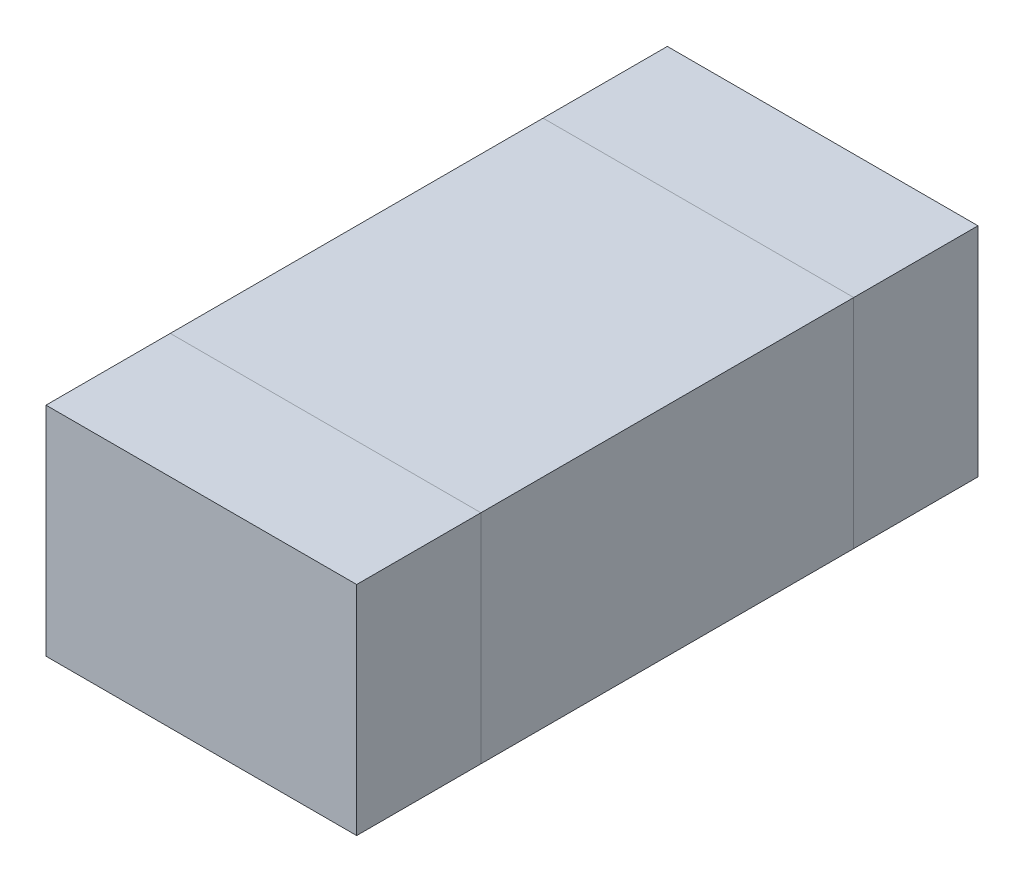
ISO-10303-21;
HEADER;
FILE_DESCRIPTION(('STEP AP214'),'2;1');
FILE_NAME('part.step','',(''),(''),'','','');
FILE_SCHEMA(('AUTOMOTIVE_DESIGN { 1 0 10303 214 1 1 1 1 }'));
ENDSEC;
DATA;
#1=APPLICATION_CONTEXT('core data for automotive mechanical design processes');
#2=APPLICATION_PROTOCOL_DEFINITION('international standard','automotive_design',2000,#1);
#3=PRODUCT_CONTEXT('',#1,'mechanical');
#4=PRODUCT('Part','Part','',(#3));
#5=PRODUCT_RELATED_PRODUCT_CATEGORY('part','',(#4));
#6=PRODUCT_DEFINITION_FORMATION('','',#4);
#7=PRODUCT_DEFINITION_CONTEXT('part definition',#1,'design');
#8=PRODUCT_DEFINITION('design','',#6,#7);
#9=PRODUCT_DEFINITION_SHAPE('','',#8);
#10=(LENGTH_UNIT() NAMED_UNIT(*) SI_UNIT(.MILLI.,.METRE.));
#11=(NAMED_UNIT(*) PLANE_ANGLE_UNIT() SI_UNIT($,.RADIAN.));
#12=(NAMED_UNIT(*) SI_UNIT($,.STERADIAN.) SOLID_ANGLE_UNIT());
#13=UNCERTAINTY_MEASURE_WITH_UNIT(LENGTH_MEASURE(1.E-05),#10,'distance_accuracy_value','');
#14=(GEOMETRIC_REPRESENTATION_CONTEXT(3) GLOBAL_UNCERTAINTY_ASSIGNED_CONTEXT((#13)) GLOBAL_UNIT_ASSIGNED_CONTEXT((#10,
#11,#12)) REPRESENTATION_CONTEXT('',''));
#15=CARTESIAN_POINT('',(0.,0.,0.));
#16=DIRECTION('',(0.,0.,1.));
#17=DIRECTION('',(1.,0.,0.));
#18=AXIS2_PLACEMENT_3D('',#15,#16,#17);
#19=CARTESIAN_POINT('',(0.,0.35,0.));
#20=DIRECTION('',(0.,1.,0.));
#21=DIRECTION('',(0.,0.,1.));
#22=AXIS2_PLACEMENT_3D('',#19,#20,#21);
#23=PLANE('',#22);
#24=DIRECTION('',(0.,0.,-1.));
#25=VECTOR('',#24,1.);
#26=CARTESIAN_POINT('',(-0.25,0.35,-0.3));
#27=LINE('',#26,#25);
#28=CARTESIAN_POINT('',(-0.25,0.35,-0.3));
#29=VERTEX_POINT('',#28);
#30=CARTESIAN_POINT('',(-0.25,0.35,-0.5));
#31=VERTEX_POINT('',#30);
#32=EDGE_CURVE('E56',#29,#31,#27,.T.);
#33=ORIENTED_EDGE('',*,*,#32,.F.);
#34=DIRECTION('',(-1.,0.,0.));
#35=VECTOR('',#34,1.);
#36=CARTESIAN_POINT('',(-0.25,0.35,-0.3));
#37=LINE('',#36,#35);
#38=CARTESIAN_POINT('',(0.25,0.35,-0.3));
#39=VERTEX_POINT('',#38);
#40=EDGE_CURVE('E79',#39,#29,#37,.T.);
#41=ORIENTED_EDGE('',*,*,#40,.F.);
#42=DIRECTION('',(0.,0.,1.));
#43=VECTOR('',#42,1.);
#44=CARTESIAN_POINT('',(0.25,0.35,-0.3));
#45=LINE('',#44,#43);
#46=CARTESIAN_POINT('',(0.25,0.35,-0.5));
#47=VERTEX_POINT('',#46);
#48=EDGE_CURVE('E84',#47,#39,#45,.T.);
#49=ORIENTED_EDGE('',*,*,#48,.F.);
#50=DIRECTION('',(1.,0.,0.));
#51=VECTOR('',#50,1.);
#52=CARTESIAN_POINT('',(-0.25,0.35,-0.5));
#53=LINE('',#52,#51);
#54=EDGE_CURVE('E99',#31,#47,#53,.T.);
#55=ORIENTED_EDGE('',*,*,#54,.F.);
#56=EDGE_LOOP('',(#33,#41,#49,#55));
#57=FACE_BOUND('',#56,.T.);
#58=ADVANCED_FACE('F48',(#57),#23,.T.);
#59=CARTESIAN_POINT('',(0.,0.,0.));
#60=DIRECTION('',(0.,-1.,0.));
#61=DIRECTION('',(0.,0.,-1.));
#62=AXIS2_PLACEMENT_3D('',#59,#60,#61);
#63=PLANE('',#62);
#64=DIRECTION('',(0.,0.,-1.));
#65=VECTOR('',#64,1.);
#66=CARTESIAN_POINT('',(-0.25,0.,-0.3));
#67=LINE('',#66,#65);
#68=CARTESIAN_POINT('',(-0.25,0.,-0.3));
#69=VERTEX_POINT('',#68);
#70=CARTESIAN_POINT('',(-0.25,0.,-0.5));
#71=VERTEX_POINT('',#70);
#72=EDGE_CURVE('E108',#69,#71,#67,.T.);
#73=ORIENTED_EDGE('',*,*,#72,.T.);
#74=DIRECTION('',(1.,0.,0.));
#75=VECTOR('',#74,1.);
#76=CARTESIAN_POINT('',(-0.25,0.,-0.5));
#77=LINE('',#76,#75);
#78=CARTESIAN_POINT('',(0.25,0.,-0.5));
#79=VERTEX_POINT('',#78);
#80=EDGE_CURVE('E97',#71,#79,#77,.T.);
#81=ORIENTED_EDGE('',*,*,#80,.T.);
#82=DIRECTION('',(0.,0.,1.));
#83=VECTOR('',#82,1.);
#84=CARTESIAN_POINT('',(0.25,0.,-0.3));
#85=LINE('',#84,#83);
#86=CARTESIAN_POINT('',(0.25,0.,-0.3));
#87=VERTEX_POINT('',#86);
#88=EDGE_CURVE('E100',#79,#87,#85,.T.);
#89=ORIENTED_EDGE('',*,*,#88,.T.);
#90=DIRECTION('',(-1.,0.,0.));
#91=VECTOR('',#90,1.);
#92=CARTESIAN_POINT('',(-0.25,0.,-0.3));
#93=LINE('',#92,#91);
#94=EDGE_CURVE('E105',#87,#69,#93,.T.);
#95=ORIENTED_EDGE('',*,*,#94,.T.);
#96=EDGE_LOOP('',(#73,#81,#89,#95));
#97=FACE_BOUND('',#96,.T.);
#98=ADVANCED_FACE('F107',(#97),#63,.T.);
#99=CARTESIAN_POINT('',(-0.25,0.888516480713451,-0.5));
#100=DIRECTION('',(0.,0.,-1.));
#101=DIRECTION('',(-1.,0.,0.));
#102=AXIS2_PLACEMENT_3D('',#99,#100,#101);
#103=PLANE('',#102);
#104=DIRECTION('',(0.,-1.,0.));
#105=VECTOR('',#104,1.);
#106=CARTESIAN_POINT('',(-0.25,0.888516480713451,-0.5));
#107=LINE('',#106,#105);
#108=EDGE_CURVE('E12',#31,#71,#107,.T.);
#109=ORIENTED_EDGE('',*,*,#108,.F.);
#110=ORIENTED_EDGE('',*,*,#54,.T.);
#111=DIRECTION('',(0.,-1.,0.));
#112=VECTOR('',#111,1.);
#113=CARTESIAN_POINT('',(0.25,0.888516480713451,-0.5));
#114=LINE('',#113,#112);
#115=EDGE_CURVE('E94',#47,#79,#114,.T.);
#116=ORIENTED_EDGE('',*,*,#115,.T.);
#117=ORIENTED_EDGE('',*,*,#80,.F.);
#118=EDGE_LOOP('',(#109,#110,#116,#117));
#119=FACE_BOUND('',#118,.T.);
#120=ADVANCED_FACE('F95',(#119),#103,.T.);
#121=CARTESIAN_POINT('',(0.25,0.888516480713451,-0.3));
#122=DIRECTION('',(1.,0.,0.));
#123=DIRECTION('',(0.,0.,-1.));
#124=AXIS2_PLACEMENT_3D('',#121,#122,#123);
#125=PLANE('',#124);
#126=ORIENTED_EDGE('',*,*,#115,.F.);
#127=ORIENTED_EDGE('',*,*,#48,.T.);
#128=DIRECTION('',(0.,-1.,0.));
#129=VECTOR('',#128,1.);
#130=CARTESIAN_POINT('',(0.25,0.888516480713451,-0.3));
#131=LINE('',#130,#129);
#132=EDGE_CURVE('E89',#39,#87,#131,.T.);
#133=ORIENTED_EDGE('',*,*,#132,.T.);
#134=ORIENTED_EDGE('',*,*,#88,.F.);
#135=EDGE_LOOP('',(#126,#127,#133,#134));
#136=FACE_BOUND('',#135,.T.);
#137=ADVANCED_FACE('F101',(#136),#125,.T.);
#138=CARTESIAN_POINT('',(-0.25,0.888516480713451,-0.3));
#139=DIRECTION('',(0.,0.,1.));
#140=DIRECTION('',(1.,0.,0.));
#141=AXIS2_PLACEMENT_3D('',#138,#139,#140);
#142=PLANE('',#141);
#143=ORIENTED_EDGE('',*,*,#132,.F.);
#144=ORIENTED_EDGE('',*,*,#40,.T.);
#145=DIRECTION('',(0.,-1.,0.));
#146=VECTOR('',#145,1.);
#147=CARTESIAN_POINT('',(-0.25,0.888516480713451,-0.3));
#148=LINE('',#147,#146);
#149=EDGE_CURVE('E115',#29,#69,#148,.T.);
#150=ORIENTED_EDGE('',*,*,#149,.T.);
#151=ORIENTED_EDGE('',*,*,#94,.F.);
#152=EDGE_LOOP('',(#143,#144,#150,#151));
#153=FACE_BOUND('',#152,.T.);
#154=ADVANCED_FACE('F121',(#153),#142,.T.);
#155=CARTESIAN_POINT('',(-0.25,0.888516480713451,-0.3));
#156=DIRECTION('',(-1.,0.,0.));
#157=DIRECTION('',(0.,0.,1.));
#158=AXIS2_PLACEMENT_3D('',#155,#156,#157);
#159=PLANE('',#158);
#160=ORIENTED_EDGE('',*,*,#149,.F.);
#161=ORIENTED_EDGE('',*,*,#32,.T.);
#162=ORIENTED_EDGE('',*,*,#108,.T.);
#163=ORIENTED_EDGE('',*,*,#72,.F.);
#164=EDGE_LOOP('',(#160,#161,#162,#163));
#165=FACE_BOUND('',#164,.T.);
#166=ADVANCED_FACE('F122',(#165),#159,.T.);
#167=CLOSED_SHELL('',(#58,#98,#120,#137,#154,#166));
#168=MANIFOLD_SOLID_BREP('B2',#167);
#169=CARTESIAN_POINT('',(0.,0.35,0.));
#170=DIRECTION('',(0.,1.,0.));
#171=DIRECTION('',(0.,0.,1.));
#172=AXIS2_PLACEMENT_3D('',#169,#170,#171);
#173=PLANE('',#172);
#174=DIRECTION('',(0.,0.,-1.));
#175=VECTOR('',#174,1.);
#176=CARTESIAN_POINT('',(-0.25,0.35,0.3));
#177=LINE('',#176,#175);
#178=CARTESIAN_POINT('',(-0.25,0.35,0.5));
#179=VERTEX_POINT('',#178);
#180=CARTESIAN_POINT('',(-0.25,0.35,0.3));
#181=VERTEX_POINT('',#180);
#182=EDGE_CURVE('E189',#179,#181,#177,.T.);
#183=ORIENTED_EDGE('',*,*,#182,.F.);
#184=DIRECTION('',(-1.,0.,0.));
#185=VECTOR('',#184,1.);
#186=CARTESIAN_POINT('',(-0.25,0.35,0.5));
#187=LINE('',#186,#185);
#188=CARTESIAN_POINT('',(0.25,0.35,0.5));
#189=VERTEX_POINT('',#188);
#190=EDGE_CURVE('E212',#189,#179,#187,.T.);
#191=ORIENTED_EDGE('',*,*,#190,.F.);
#192=DIRECTION('',(0.,0.,1.));
#193=VECTOR('',#192,1.);
#194=CARTESIAN_POINT('',(0.25,0.35,0.3));
#195=LINE('',#194,#193);
#196=CARTESIAN_POINT('',(0.25,0.35,0.3));
#197=VERTEX_POINT('',#196);
#198=EDGE_CURVE('E217',#197,#189,#195,.T.);
#199=ORIENTED_EDGE('',*,*,#198,.F.);
#200=DIRECTION('',(1.,0.,0.));
#201=VECTOR('',#200,1.);
#202=CARTESIAN_POINT('',(-0.25,0.35,0.3));
#203=LINE('',#202,#201);
#204=EDGE_CURVE('E232',#181,#197,#203,.T.);
#205=ORIENTED_EDGE('',*,*,#204,.F.);
#206=EDGE_LOOP('',(#183,#191,#199,#205));
#207=FACE_BOUND('',#206,.T.);
#208=ADVANCED_FACE('F181',(#207),#173,.T.);
#209=CARTESIAN_POINT('',(0.,0.,0.));
#210=DIRECTION('',(0.,1.,0.));
#211=DIRECTION('',(0.,0.,1.));
#212=AXIS2_PLACEMENT_3D('',#209,#210,#211);
#213=PLANE('',#212);
#214=DIRECTION('',(0.,0.,-1.));
#215=VECTOR('',#214,1.);
#216=CARTESIAN_POINT('',(-0.25,0.,0.3));
#217=LINE('',#216,#215);
#218=CARTESIAN_POINT('',(-0.25,0.,0.5));
#219=VERTEX_POINT('',#218);
#220=CARTESIAN_POINT('',(-0.25,0.,0.3));
#221=VERTEX_POINT('',#220);
#222=EDGE_CURVE('E241',#219,#221,#217,.T.);
#223=ORIENTED_EDGE('',*,*,#222,.T.);
#224=DIRECTION('',(1.,0.,0.));
#225=VECTOR('',#224,1.);
#226=CARTESIAN_POINT('',(-0.25,0.,0.3));
#227=LINE('',#226,#225);
#228=CARTESIAN_POINT('',(0.25,0.,0.3));
#229=VERTEX_POINT('',#228);
#230=EDGE_CURVE('E230',#221,#229,#227,.T.);
#231=ORIENTED_EDGE('',*,*,#230,.T.);
#232=DIRECTION('',(0.,0.,1.));
#233=VECTOR('',#232,1.);
#234=CARTESIAN_POINT('',(0.25,0.,0.3));
#235=LINE('',#234,#233);
#236=CARTESIAN_POINT('',(0.25,0.,0.5));
#237=VERTEX_POINT('',#236);
#238=EDGE_CURVE('E233',#229,#237,#235,.T.);
#239=ORIENTED_EDGE('',*,*,#238,.T.);
#240=DIRECTION('',(-1.,0.,0.));
#241=VECTOR('',#240,1.);
#242=CARTESIAN_POINT('',(-0.25,0.,0.5));
#243=LINE('',#242,#241);
#244=EDGE_CURVE('E238',#237,#219,#243,.T.);
#245=ORIENTED_EDGE('',*,*,#244,.T.);
#246=EDGE_LOOP('',(#223,#231,#239,#245));
#247=FACE_BOUND('',#246,.T.);
#248=ADVANCED_FACE('F240',(#247),#213,.F.);
#249=CARTESIAN_POINT('',(-0.25,0.88851648071345,0.3));
#250=DIRECTION('',(0.,0.,-1.));
#251=DIRECTION('',(-1.,0.,0.));
#252=AXIS2_PLACEMENT_3D('',#249,#250,#251);
#253=PLANE('',#252);
#254=DIRECTION('',(0.,-1.,0.));
#255=VECTOR('',#254,1.);
#256=CARTESIAN_POINT('',(-0.25,0.88851648071345,0.3));
#257=LINE('',#256,#255);
#258=EDGE_CURVE('E46',#181,#221,#257,.T.);
#259=ORIENTED_EDGE('',*,*,#258,.F.);
#260=ORIENTED_EDGE('',*,*,#204,.T.);
#261=DIRECTION('',(0.,-1.,0.));
#262=VECTOR('',#261,1.);
#263=CARTESIAN_POINT('',(0.25,0.88851648071345,0.3));
#264=LINE('',#263,#262);
#265=EDGE_CURVE('E227',#197,#229,#264,.T.);
#266=ORIENTED_EDGE('',*,*,#265,.T.);
#267=ORIENTED_EDGE('',*,*,#230,.F.);
#268=EDGE_LOOP('',(#259,#260,#266,#267));
#269=FACE_BOUND('',#268,.T.);
#270=ADVANCED_FACE('F228',(#269),#253,.T.);
#271=CARTESIAN_POINT('',(0.25,0.88851648071345,0.3));
#272=DIRECTION('',(1.,0.,0.));
#273=DIRECTION('',(0.,0.,-1.));
#274=AXIS2_PLACEMENT_3D('',#271,#272,#273);
#275=PLANE('',#274);
#276=ORIENTED_EDGE('',*,*,#265,.F.);
#277=ORIENTED_EDGE('',*,*,#198,.T.);
#278=DIRECTION('',(0.,-1.,0.));
#279=VECTOR('',#278,1.);
#280=CARTESIAN_POINT('',(0.25,0.88851648071345,0.5));
#281=LINE('',#280,#279);
#282=EDGE_CURVE('E222',#189,#237,#281,.T.);
#283=ORIENTED_EDGE('',*,*,#282,.T.);
#284=ORIENTED_EDGE('',*,*,#238,.F.);
#285=EDGE_LOOP('',(#276,#277,#283,#284));
#286=FACE_BOUND('',#285,.T.);
#287=ADVANCED_FACE('F234',(#286),#275,.T.);
#288=CARTESIAN_POINT('',(-0.25,0.88851648071345,0.5));
#289=DIRECTION('',(0.,0.,1.));
#290=DIRECTION('',(1.,0.,0.));
#291=AXIS2_PLACEMENT_3D('',#288,#289,#290);
#292=PLANE('',#291);
#293=ORIENTED_EDGE('',*,*,#282,.F.);
#294=ORIENTED_EDGE('',*,*,#190,.T.);
#295=DIRECTION('',(0.,-1.,0.));
#296=VECTOR('',#295,1.);
#297=CARTESIAN_POINT('',(-0.25,0.88851648071345,0.5));
#298=LINE('',#297,#296);
#299=EDGE_CURVE('E248',#179,#219,#298,.T.);
#300=ORIENTED_EDGE('',*,*,#299,.T.);
#301=ORIENTED_EDGE('',*,*,#244,.F.);
#302=EDGE_LOOP('',(#293,#294,#300,#301));
#303=FACE_BOUND('',#302,.T.);
#304=ADVANCED_FACE('F254',(#303),#292,.T.);
#305=CARTESIAN_POINT('',(-0.25,0.88851648071345,0.3));
#306=DIRECTION('',(-1.,0.,0.));
#307=DIRECTION('',(0.,0.,1.));
#308=AXIS2_PLACEMENT_3D('',#305,#306,#307);
#309=PLANE('',#308);
#310=ORIENTED_EDGE('',*,*,#299,.F.);
#311=ORIENTED_EDGE('',*,*,#182,.T.);
#312=ORIENTED_EDGE('',*,*,#258,.T.);
#313=ORIENTED_EDGE('',*,*,#222,.F.);
#314=EDGE_LOOP('',(#310,#311,#312,#313));
#315=FACE_BOUND('',#314,.T.);
#316=ADVANCED_FACE('F255',(#315),#309,.T.);
#317=CLOSED_SHELL('',(#208,#248,#270,#287,#304,#316));
#318=MANIFOLD_SOLID_BREP('B6',#317);
#319=CARTESIAN_POINT('',(0.25,0.35,-0.3));
#320=DIRECTION('',(-1.,0.,0.));
#321=DIRECTION('',(0.,0.,1.));
#322=AXIS2_PLACEMENT_3D('',#319,#320,#321);
#323=PLANE('',#322);
#324=DIRECTION('',(0.,0.,-1.));
#325=VECTOR('',#324,1.);
#326=CARTESIAN_POINT('',(0.25,0.,-0.3));
#327=LINE('',#326,#325);
#328=CARTESIAN_POINT('',(0.25,0.,0.3));
#329=VERTEX_POINT('',#328);
#330=CARTESIAN_POINT('',(0.25,0.,-0.3));
#331=VERTEX_POINT('',#330);
#332=EDGE_CURVE('E368',#329,#331,#327,.T.);
#333=ORIENTED_EDGE('',*,*,#332,.T.);
#334=DIRECTION('',(0.,-1.,0.));
#335=VECTOR('',#334,1.);
#336=CARTESIAN_POINT('',(0.25,0.35,-0.3));
#337=LINE('',#336,#335);
#338=CARTESIAN_POINT('',(0.25,0.35,-0.3));
#339=VERTEX_POINT('',#338);
#340=EDGE_CURVE('E179',#339,#331,#337,.T.);
#341=ORIENTED_EDGE('',*,*,#340,.F.);
#342=DIRECTION('',(0.,0.,-1.));
#343=VECTOR('',#342,1.);
#344=CARTESIAN_POINT('',(0.25,0.35,-0.3));
#345=LINE('',#344,#343);
#346=CARTESIAN_POINT('',(0.25,0.35,0.3));
#347=VERTEX_POINT('',#346);
#348=EDGE_CURVE('E356',#347,#339,#345,.T.);
#349=ORIENTED_EDGE('',*,*,#348,.F.);
#350=DIRECTION('',(0.,-1.,0.));
#351=VECTOR('',#350,1.);
#352=CARTESIAN_POINT('',(0.25,0.35,0.3));
#353=LINE('',#352,#351);
#354=EDGE_CURVE('E364',#347,#329,#353,.T.);
#355=ORIENTED_EDGE('',*,*,#354,.T.);
#356=EDGE_LOOP('',(#333,#341,#349,#355));
#357=FACE_BOUND('',#356,.T.);
#358=ADVANCED_FACE('F305',(#357),#323,.F.);
#359=CARTESIAN_POINT('',(-0.25,0.35,-0.3));
#360=DIRECTION('',(0.,0.,1.));
#361=DIRECTION('',(1.,0.,0.));
#362=AXIS2_PLACEMENT_3D('',#359,#360,#361);
#363=PLANE('',#362);
#364=DIRECTION('',(-1.,0.,0.));
#365=VECTOR('',#364,1.);
#366=CARTESIAN_POINT('',(-0.25,0.,-0.3));
#367=LINE('',#366,#365);
#368=CARTESIAN_POINT('',(-0.25,0.,-0.3));
#369=VERTEX_POINT('',#368);
#370=EDGE_CURVE('E360',#331,#369,#367,.T.);
#371=ORIENTED_EDGE('',*,*,#370,.T.);
#372=DIRECTION('',(0.,-1.,0.));
#373=VECTOR('',#372,1.);
#374=CARTESIAN_POINT('',(-0.25,0.35,-0.3));
#375=LINE('',#374,#373);
#376=CARTESIAN_POINT('',(-0.25,0.35,-0.3));
#377=VERTEX_POINT('',#376);
#378=EDGE_CURVE('E313',#377,#369,#375,.T.);
#379=ORIENTED_EDGE('',*,*,#378,.F.);
#380=DIRECTION('',(-1.,0.,0.));
#381=VECTOR('',#380,1.);
#382=CARTESIAN_POINT('',(-0.25,0.35,-0.3));
#383=LINE('',#382,#381);
#384=EDGE_CURVE('E351',#339,#377,#383,.T.);
#385=ORIENTED_EDGE('',*,*,#384,.F.);
#386=ORIENTED_EDGE('',*,*,#340,.T.);
#387=EDGE_LOOP('',(#371,#379,#385,#386));
#388=FACE_BOUND('',#387,.T.);
#389=ADVANCED_FACE('F359',(#388),#363,.F.);
#390=CARTESIAN_POINT('',(-0.25,0.35,-0.3));
#391=DIRECTION('',(1.,0.,0.));
#392=DIRECTION('',(0.,0.,-1.));
#393=AXIS2_PLACEMENT_3D('',#390,#391,#392);
#394=PLANE('',#393);
#395=DIRECTION('',(0.,0.,1.));
#396=VECTOR('',#395,1.);
#397=CARTESIAN_POINT('',(-0.25,0.,-0.3));
#398=LINE('',#397,#396);
#399=CARTESIAN_POINT('',(-0.25,0.,0.3));
#400=VERTEX_POINT('',#399);
#401=EDGE_CURVE('E338',#369,#400,#398,.T.);
#402=ORIENTED_EDGE('',*,*,#401,.T.);
#403=DIRECTION('',(0.,-1.,0.));
#404=VECTOR('',#403,1.);
#405=CARTESIAN_POINT('',(-0.25,0.35,0.3));
#406=LINE('',#405,#404);
#407=CARTESIAN_POINT('',(-0.25,0.35,0.3));
#408=VERTEX_POINT('',#407);
#409=EDGE_CURVE('E361',#408,#400,#406,.T.);
#410=ORIENTED_EDGE('',*,*,#409,.F.);
#411=DIRECTION('',(0.,0.,1.));
#412=VECTOR('',#411,1.);
#413=CARTESIAN_POINT('',(-0.25,0.35,-0.3));
#414=LINE('',#413,#412);
#415=EDGE_CURVE('E354',#377,#408,#414,.T.);
#416=ORIENTED_EDGE('',*,*,#415,.F.);
#417=ORIENTED_EDGE('',*,*,#378,.T.);
#418=EDGE_LOOP('',(#402,#410,#416,#417));
#419=FACE_BOUND('',#418,.T.);
#420=ADVANCED_FACE('F362',(#419),#394,.F.);
#421=CARTESIAN_POINT('',(-0.25,0.35,0.3));
#422=DIRECTION('',(0.,0.,-1.));
#423=DIRECTION('',(-1.,0.,0.));
#424=AXIS2_PLACEMENT_3D('',#421,#422,#423);
#425=PLANE('',#424);
#426=DIRECTION('',(1.,0.,0.));
#427=VECTOR('',#426,1.);
#428=CARTESIAN_POINT('',(-0.25,0.,0.3));
#429=LINE('',#428,#427);
#430=EDGE_CURVE('E344',#400,#329,#429,.T.);
#431=ORIENTED_EDGE('',*,*,#430,.T.);
#432=ORIENTED_EDGE('',*,*,#354,.F.);
#433=DIRECTION('',(1.,0.,0.));
#434=VECTOR('',#433,1.);
#435=CARTESIAN_POINT('',(-0.25,0.35,0.3));
#436=LINE('',#435,#434);
#437=EDGE_CURVE('E321',#408,#347,#436,.T.);
#438=ORIENTED_EDGE('',*,*,#437,.F.);
#439=ORIENTED_EDGE('',*,*,#409,.T.);
#440=EDGE_LOOP('',(#431,#432,#438,#439));
#441=FACE_BOUND('',#440,.T.);
#442=ADVANCED_FACE('F375',(#441),#425,.F.);
#443=CARTESIAN_POINT('',(0.,0.35,0.));
#444=DIRECTION('',(0.,1.,0.));
#445=DIRECTION('',(0.,0.,1.));
#446=AXIS2_PLACEMENT_3D('',#443,#444,#445);
#447=PLANE('',#446);
#448=ORIENTED_EDGE('',*,*,#348,.T.);
#449=ORIENTED_EDGE('',*,*,#384,.T.);
#450=ORIENTED_EDGE('',*,*,#415,.T.);
#451=ORIENTED_EDGE('',*,*,#437,.T.);
#452=EDGE_LOOP('',(#448,#449,#450,#451));
#453=FACE_BOUND('',#452,.T.);
#454=ADVANCED_FACE('F352',(#453),#447,.T.);
#455=CARTESIAN_POINT('',(0.,0.,0.));
#456=DIRECTION('',(0.,1.,0.));
#457=DIRECTION('',(0.,0.,1.));
#458=AXIS2_PLACEMENT_3D('',#455,#456,#457);
#459=PLANE('',#458);
#460=ORIENTED_EDGE('',*,*,#332,.F.);
#461=ORIENTED_EDGE('',*,*,#430,.F.);
#462=ORIENTED_EDGE('',*,*,#401,.F.);
#463=ORIENTED_EDGE('',*,*,#370,.F.);
#464=EDGE_LOOP('',(#460,#461,#462,#463));
#465=FACE_BOUND('',#464,.T.);
#466=ADVANCED_FACE('F378',(#465),#459,.F.);
#467=CLOSED_SHELL('',(#358,#389,#420,#442,#454,#466));
#468=MANIFOLD_SOLID_BREP('B40',#467);
#469=ADVANCED_BREP_SHAPE_REPRESENTATION('',(#18,#168,#318,#468),#14);
#470=SHAPE_DEFINITION_REPRESENTATION(#9,#469);
ENDSEC;
END-ISO-10303-21;
